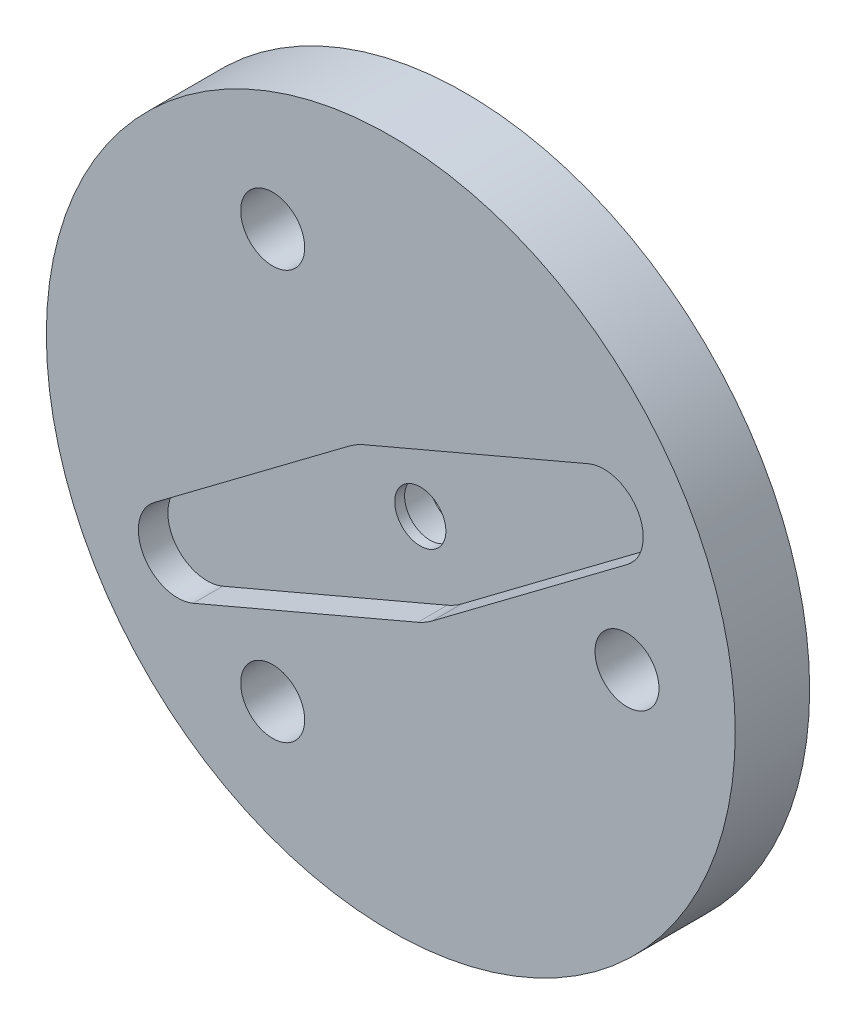
ISO-10303-21;
HEADER;
FILE_DESCRIPTION(('STEP AP214'),'2;1');
FILE_NAME('part.step','',(''),(''),'','','');
FILE_SCHEMA(('AUTOMOTIVE_DESIGN { 1 0 10303 214 1 1 1 1 }'));
ENDSEC;
DATA;
#1=APPLICATION_CONTEXT('core data for automotive mechanical design processes');
#2=APPLICATION_PROTOCOL_DEFINITION('international standard','automotive_design',2000,#1);
#3=PRODUCT_CONTEXT('',#1,'mechanical');
#4=PRODUCT('Part','Part','',(#3));
#5=PRODUCT_RELATED_PRODUCT_CATEGORY('part','',(#4));
#6=PRODUCT_DEFINITION_FORMATION('','',#4);
#7=PRODUCT_DEFINITION_CONTEXT('part definition',#1,'design');
#8=PRODUCT_DEFINITION('design','',#6,#7);
#9=PRODUCT_DEFINITION_SHAPE('','',#8);
#10=(LENGTH_UNIT() NAMED_UNIT(*) SI_UNIT(.MILLI.,.METRE.));
#11=(NAMED_UNIT(*) PLANE_ANGLE_UNIT() SI_UNIT($,.RADIAN.));
#12=(NAMED_UNIT(*) SI_UNIT($,.STERADIAN.) SOLID_ANGLE_UNIT());
#13=UNCERTAINTY_MEASURE_WITH_UNIT(LENGTH_MEASURE(1.E-05),#10,'distance_accuracy_value','');
#14=(GEOMETRIC_REPRESENTATION_CONTEXT(3) GLOBAL_UNCERTAINTY_ASSIGNED_CONTEXT((#13)) GLOBAL_UNIT_ASSIGNED_CONTEXT((#10,
#11,#12)) REPRESENTATION_CONTEXT('',''));
#15=CARTESIAN_POINT('',(0.,0.,0.));
#16=DIRECTION('',(0.,0.,1.));
#17=DIRECTION('',(1.,0.,0.));
#18=AXIS2_PLACEMENT_3D('',#15,#16,#17);
#19=CARTESIAN_POINT('',(0.,0.,0.));
#20=DIRECTION('',(0.,0.,1.));
#21=DIRECTION('',(1.,0.,0.));
#22=AXIS2_PLACEMENT_3D('',#19,#20,#21);
#23=CYLINDRICAL_SURFACE('',#22,1.3);
#24=CARTESIAN_POINT('',(0.,0.,1.78109250195854));
#25=DIRECTION('',(0.,0.,1.));
#26=DIRECTION('',(1.,0.,0.));
#27=AXIS2_PLACEMENT_3D('',#24,#25,#26);
#28=CIRCLE('',#27,1.3);
#29=CARTESIAN_POINT('',(1.3,0.,1.78109250195854));
#30=VERTEX_POINT('',#29);
#31=EDGE_CURVE('E44',#30,#30,#28,.F.);
#32=ORIENTED_EDGE('',*,*,#31,.T.);
#33=EDGE_LOOP('',(#32));
#34=FACE_BOUND('',#33,.T.);
#35=CARTESIAN_POINT('',(0.,0.,2.28109250195854));
#36=DIRECTION('',(0.,0.,1.));
#37=DIRECTION('',(1.,0.,0.));
#38=AXIS2_PLACEMENT_3D('',#35,#36,#37);
#39=CIRCLE('',#38,1.3);
#40=CARTESIAN_POINT('',(1.3,0.,2.28109250195854));
#41=VERTEX_POINT('',#40);
#42=EDGE_CURVE('E178',#41,#41,#39,.F.);
#43=ORIENTED_EDGE('',*,*,#42,.F.);
#44=EDGE_LOOP('',(#43));
#45=FACE_BOUND('',#44,.T.);
#46=ADVANCED_FACE('F40',(#34,#45),#23,.F.);
#47=CARTESIAN_POINT('',(0.,0.,3.78109250195854));
#48=DIRECTION('',(0.,0.,-1.));
#49=DIRECTION('',(-1.,0.,0.));
#50=AXIS2_PLACEMENT_3D('',#47,#48,#49);
#51=CYLINDRICAL_SURFACE('',#50,17.5);
#52=CARTESIAN_POINT('',(0.,0.,3.78109250195854));
#53=DIRECTION('',(0.,0.,1.));
#54=DIRECTION('',(1.,0.,0.));
#55=AXIS2_PLACEMENT_3D('',#52,#53,#54);
#56=CIRCLE('',#55,17.5);
#57=CARTESIAN_POINT('',(17.5,0.,3.78109250195854));
#58=VERTEX_POINT('',#57);
#59=EDGE_CURVE('E12',#58,#58,#56,.T.);
#60=ORIENTED_EDGE('',*,*,#59,.F.);
#61=EDGE_LOOP('',(#60));
#62=FACE_BOUND('',#61,.T.);
#63=CARTESIAN_POINT('',(0.,0.,0.));
#64=DIRECTION('',(0.,0.,1.));
#65=DIRECTION('',(1.,0.,0.));
#66=AXIS2_PLACEMENT_3D('',#63,#64,#65);
#67=CIRCLE('',#66,17.5);
#68=CARTESIAN_POINT('',(17.5,0.,0.));
#69=VERTEX_POINT('',#68);
#70=EDGE_CURVE('E50',#69,#69,#67,.T.);
#71=ORIENTED_EDGE('',*,*,#70,.T.);
#72=EDGE_LOOP('',(#71));
#73=FACE_BOUND('',#72,.T.);
#74=ADVANCED_FACE('F42',(#62,#73),#51,.T.);
#75=CARTESIAN_POINT('',(0.,0.,3.78109250195854));
#76=DIRECTION('',(0.,0.,1.));
#77=DIRECTION('',(1.,0.,0.));
#78=AXIS2_PLACEMENT_3D('',#75,#76,#77);
#79=PLANE('',#78);
#80=CARTESIAN_POINT('',(10.8253175473055,6.24999999999998,3.78109250195854));
#81=DIRECTION('',(0.,0.,1.));
#82=DIRECTION('',(1.,0.,0.));
#83=AXIS2_PLACEMENT_3D('',#80,#81,#82);
#84=CIRCLE('',#83,2.);
#85=CARTESIAN_POINT('',(12.025937535893,4.6504651791836,3.78109250195854));
#86=VERTEX_POINT('',#85);
#87=CARTESIAN_POINT('',(10.0403897525345,8.08953482081635,3.78109250195854));
#88=VERTEX_POINT('',#87);
#89=EDGE_CURVE('E58',#86,#88,#84,.T.);
#90=ORIENTED_EDGE('',*,*,#89,.F.);
#91=DIRECTION('',(0.799767410408188,0.600309994293765,0.));
#92=VECTOR('',#91,1.);
#93=CARTESIAN_POINT('',(2.10108498002818,-2.79918593642866,3.78109250195854));
#94=LINE('',#93,#92);
#95=CARTESIAN_POINT('',(2.10108498002818,-2.79918593642866,3.78109250195854));
#96=VERTEX_POINT('',#95);
#97=EDGE_CURVE('E172',#96,#86,#94,.T.);
#98=ORIENTED_EDGE('',*,*,#97,.F.);
#99=CARTESIAN_POINT('',(0.,0.,3.78109250195854));
#100=DIRECTION('',(0.,0.,1.));
#101=DIRECTION('',(1.,0.,0.));
#102=AXIS2_PLACEMENT_3D('',#99,#100,#101);
#103=CIRCLE('',#102,3.5);
#104=CARTESIAN_POINT('',(1.37362364084925,-3.21918593642866,3.78109250195854));
#105=VERTEX_POINT('',#104);
#106=EDGE_CURVE('E169',#105,#96,#103,.T.);
#107=ORIENTED_EDGE('',*,*,#106,.F.);
#108=DIRECTION('',(0.919767410408188,0.3924638973855,0.));
#109=VECTOR('',#108,1.);
#110=CARTESIAN_POINT('',(-10.0403897525345,-8.08953482081635,3.78109250195854));
#111=LINE('',#110,#109);
#112=CARTESIAN_POINT('',(-10.0403897525345,-8.08953482081635,3.78109250195854));
#113=VERTEX_POINT('',#112);
#114=EDGE_CURVE('E118',#113,#105,#111,.T.);
#115=ORIENTED_EDGE('',*,*,#114,.F.);
#116=CARTESIAN_POINT('',(-10.8253175473055,-6.24999999999998,3.78109250195854));
#117=DIRECTION('',(0.,0.,1.));
#118=DIRECTION('',(1.,0.,0.));
#119=AXIS2_PLACEMENT_3D('',#116,#117,#118);
#120=CIRCLE('',#119,2.);
#121=CARTESIAN_POINT('',(-12.025937535893,-4.6504651791836,3.78109250195854));
#122=VERTEX_POINT('',#121);
#123=EDGE_CURVE('E163',#122,#113,#120,.T.);
#124=ORIENTED_EDGE('',*,*,#123,.F.);
#125=DIRECTION('',(-0.799767410408188,-0.600309994293765,0.));
#126=VECTOR('',#125,1.);
#127=CARTESIAN_POINT('',(-2.10108498002818,2.79918593642866,3.78109250195854));
#128=LINE('',#127,#126);
#129=CARTESIAN_POINT('',(-2.10108498002818,2.79918593642866,3.78109250195854));
#130=VERTEX_POINT('',#129);
#131=EDGE_CURVE('E159',#130,#122,#128,.T.);
#132=ORIENTED_EDGE('',*,*,#131,.F.);
#133=CARTESIAN_POINT('',(0.,0.,3.78109250195854));
#134=DIRECTION('',(0.,0.,1.));
#135=DIRECTION('',(1.,0.,0.));
#136=AXIS2_PLACEMENT_3D('',#133,#134,#135);
#137=CIRCLE('',#136,3.5);
#138=CARTESIAN_POINT('',(-1.37362364084925,3.21918593642866,3.78109250195854));
#139=VERTEX_POINT('',#138);
#140=EDGE_CURVE('E155',#139,#130,#137,.T.);
#141=ORIENTED_EDGE('',*,*,#140,.F.);
#142=DIRECTION('',(-0.919767410408188,-0.3924638973855,0.));
#143=VECTOR('',#142,1.);
#144=CARTESIAN_POINT('',(10.0403897525345,8.08953482081635,3.78109250195854));
#145=LINE('',#144,#143);
#146=EDGE_CURVE('E151',#88,#139,#145,.T.);
#147=ORIENTED_EDGE('',*,*,#146,.F.);
#148=EDGE_LOOP('',(#90,#98,#107,#115,#124,#132,#141,#147));
#149=FACE_BOUND('',#148,.T.);
#150=CARTESIAN_POINT('',(-5.99999999999998,10.3923048454133,3.78109250195854));
#151=DIRECTION('',(0.,0.,1.));
#152=DIRECTION('',(1.,0.,0.));
#153=AXIS2_PLACEMENT_3D('',#150,#151,#152);
#154=CIRCLE('',#153,1.625);
#155=CARTESIAN_POINT('',(-4.37499999999998,10.3923048454133,3.78109250195854));
#156=VERTEX_POINT('',#155);
#157=EDGE_CURVE('E198',#156,#156,#154,.T.);
#158=ORIENTED_EDGE('',*,*,#157,.F.);
#159=EDGE_LOOP('',(#158));
#160=FACE_BOUND('',#159,.T.);
#161=CARTESIAN_POINT('',(-5.99999999999997,-10.3923048454133,3.78109250195854));
#162=DIRECTION('',(0.,0.,1.));
#163=DIRECTION('',(1.,0.,0.));
#164=AXIS2_PLACEMENT_3D('',#161,#162,#163);
#165=CIRCLE('',#164,1.625);
#166=CARTESIAN_POINT('',(-4.37499999999997,-10.3923048454133,3.78109250195854));
#167=VERTEX_POINT('',#166);
#168=EDGE_CURVE('E206',#167,#167,#165,.T.);
#169=ORIENTED_EDGE('',*,*,#168,.F.);
#170=EDGE_LOOP('',(#169));
#171=FACE_BOUND('',#170,.T.);
#172=CARTESIAN_POINT('',(12.,0.,3.78109250195854));
#173=DIRECTION('',(0.,0.,1.));
#174=DIRECTION('',(1.,0.,0.));
#175=AXIS2_PLACEMENT_3D('',#172,#173,#174);
#176=CIRCLE('',#175,1.625);
#177=CARTESIAN_POINT('',(13.625,0.,3.78109250195854));
#178=VERTEX_POINT('',#177);
#179=EDGE_CURVE('E214',#178,#178,#176,.T.);
#180=ORIENTED_EDGE('',*,*,#179,.F.);
#181=EDGE_LOOP('',(#180));
#182=FACE_BOUND('',#181,.T.);
#183=ORIENTED_EDGE('',*,*,#59,.T.);
#184=EDGE_LOOP('',(#183));
#185=FACE_BOUND('',#184,.T.);
#186=ADVANCED_FACE('F232',(#149,#160,#171,#182,#185),#79,.T.);
#187=CARTESIAN_POINT('',(0.,0.,0.));
#188=DIRECTION('',(0.,0.,1.));
#189=DIRECTION('',(1.,0.,0.));
#190=AXIS2_PLACEMENT_3D('',#187,#188,#189);
#191=PLANE('',#190);
#192=CARTESIAN_POINT('',(0.,0.,0.));
#193=DIRECTION('',(0.,0.,-1.));
#194=DIRECTION('',(-1.,0.,0.));
#195=AXIS2_PLACEMENT_3D('',#192,#193,#194);
#196=CIRCLE('',#195,2.);
#197=CARTESIAN_POINT('',(-2.,0.,0.));
#198=VERTEX_POINT('',#197);
#199=EDGE_CURVE('E257',#198,#198,#196,.T.);
#200=ORIENTED_EDGE('',*,*,#199,.F.);
#201=EDGE_LOOP('',(#200));
#202=FACE_BOUND('',#201,.T.);
#203=CARTESIAN_POINT('',(-5.99999999999998,10.3923048454133,0.));
#204=DIRECTION('',(0.,0.,1.));
#205=DIRECTION('',(1.,0.,0.));
#206=AXIS2_PLACEMENT_3D('',#203,#204,#205);
#207=CIRCLE('',#206,1.625);
#208=CARTESIAN_POINT('',(-4.37499999999998,10.3923048454133,0.));
#209=VERTEX_POINT('',#208);
#210=EDGE_CURVE('E194',#209,#209,#207,.T.);
#211=ORIENTED_EDGE('',*,*,#210,.T.);
#212=EDGE_LOOP('',(#211));
#213=FACE_BOUND('',#212,.T.);
#214=CARTESIAN_POINT('',(-5.99999999999997,-10.3923048454133,0.));
#215=DIRECTION('',(0.,0.,1.));
#216=DIRECTION('',(1.,0.,0.));
#217=AXIS2_PLACEMENT_3D('',#214,#215,#216);
#218=CIRCLE('',#217,1.625);
#219=CARTESIAN_POINT('',(-4.37499999999997,-10.3923048454133,0.));
#220=VERTEX_POINT('',#219);
#221=EDGE_CURVE('E202',#220,#220,#218,.T.);
#222=ORIENTED_EDGE('',*,*,#221,.T.);
#223=EDGE_LOOP('',(#222));
#224=FACE_BOUND('',#223,.T.);
#225=CARTESIAN_POINT('',(12.,0.,0.));
#226=DIRECTION('',(0.,0.,1.));
#227=DIRECTION('',(1.,0.,0.));
#228=AXIS2_PLACEMENT_3D('',#225,#226,#227);
#229=CIRCLE('',#228,1.625);
#230=CARTESIAN_POINT('',(13.625,0.,0.));
#231=VERTEX_POINT('',#230);
#232=EDGE_CURVE('E210',#231,#231,#229,.T.);
#233=ORIENTED_EDGE('',*,*,#232,.T.);
#234=EDGE_LOOP('',(#233));
#235=FACE_BOUND('',#234,.T.);
#236=ORIENTED_EDGE('',*,*,#70,.F.);
#237=EDGE_LOOP('',(#236));
#238=FACE_BOUND('',#237,.T.);
#239=ADVANCED_FACE('F246',(#202,#213,#224,#235,#238),#191,.F.);
#240=CARTESIAN_POINT('',(12.,0.,0.));
#241=DIRECTION('',(0.,0.,1.));
#242=DIRECTION('',(1.,0.,0.));
#243=AXIS2_PLACEMENT_3D('',#240,#241,#242);
#244=CYLINDRICAL_SURFACE('',#243,1.625);
#245=ORIENTED_EDGE('',*,*,#232,.F.);
#246=EDGE_LOOP('',(#245));
#247=FACE_BOUND('',#246,.T.);
#248=ORIENTED_EDGE('',*,*,#179,.T.);
#249=EDGE_LOOP('',(#248));
#250=FACE_BOUND('',#249,.T.);
#251=ADVANCED_FACE('F242',(#247,#250),#244,.F.);
#252=CARTESIAN_POINT('',(-5.99999999999997,-10.3923048454133,0.));
#253=DIRECTION('',(0.,0.,1.));
#254=DIRECTION('',(1.,0.,0.));
#255=AXIS2_PLACEMENT_3D('',#252,#253,#254);
#256=CYLINDRICAL_SURFACE('',#255,1.625);
#257=ORIENTED_EDGE('',*,*,#221,.F.);
#258=EDGE_LOOP('',(#257));
#259=FACE_BOUND('',#258,.T.);
#260=ORIENTED_EDGE('',*,*,#168,.T.);
#261=EDGE_LOOP('',(#260));
#262=FACE_BOUND('',#261,.T.);
#263=ADVANCED_FACE('F239',(#259,#262),#256,.F.);
#264=CARTESIAN_POINT('',(-5.99999999999998,10.3923048454133,0.));
#265=DIRECTION('',(0.,0.,1.));
#266=DIRECTION('',(1.,0.,0.));
#267=AXIS2_PLACEMENT_3D('',#264,#265,#266);
#268=CYLINDRICAL_SURFACE('',#267,1.625);
#269=ORIENTED_EDGE('',*,*,#210,.F.);
#270=EDGE_LOOP('',(#269));
#271=FACE_BOUND('',#270,.T.);
#272=ORIENTED_EDGE('',*,*,#157,.T.);
#273=EDGE_LOOP('',(#272));
#274=FACE_BOUND('',#273,.T.);
#275=ADVANCED_FACE('F237',(#271,#274),#268,.F.);
#276=CARTESIAN_POINT('',(10.8253175473055,6.24999999999998,2.28109250195854));
#277=DIRECTION('',(0.,0.,1.));
#278=DIRECTION('',(1.,0.,0.));
#279=AXIS2_PLACEMENT_3D('',#276,#277,#278);
#280=PLANE('',#279);
#281=CARTESIAN_POINT('',(10.8253175473055,6.24999999999998,2.28109250195854));
#282=DIRECTION('',(0.,0.,1.));
#283=DIRECTION('',(1.,0.,0.));
#284=AXIS2_PLACEMENT_3D('',#281,#282,#283);
#285=CIRCLE('',#284,2.);
#286=CARTESIAN_POINT('',(12.025937535893,4.6504651791836,2.28109250195854));
#287=VERTEX_POINT('',#286);
#288=CARTESIAN_POINT('',(10.0403897525345,8.08953482081635,2.28109250195854));
#289=VERTEX_POINT('',#288);
#290=EDGE_CURVE('E175',#287,#289,#285,.T.);
#291=ORIENTED_EDGE('',*,*,#290,.T.);
#292=DIRECTION('',(-0.919767410408188,-0.3924638973855,0.));
#293=VECTOR('',#292,1.);
#294=CARTESIAN_POINT('',(10.0403897525345,8.08953482081635,2.28109250195854));
#295=LINE('',#294,#293);
#296=CARTESIAN_POINT('',(-1.37362364084925,3.21918593642866,2.28109250195854));
#297=VERTEX_POINT('',#296);
#298=EDGE_CURVE('E327',#289,#297,#295,.T.);
#299=ORIENTED_EDGE('',*,*,#298,.T.);
#300=CARTESIAN_POINT('',(0.,0.,2.28109250195854));
#301=DIRECTION('',(0.,0.,1.));
#302=DIRECTION('',(1.,0.,0.));
#303=AXIS2_PLACEMENT_3D('',#300,#301,#302);
#304=CIRCLE('',#303,3.5);
#305=CARTESIAN_POINT('',(-2.10108498002818,2.79918593642866,2.28109250195854));
#306=VERTEX_POINT('',#305);
#307=EDGE_CURVE('E324',#297,#306,#304,.T.);
#308=ORIENTED_EDGE('',*,*,#307,.T.);
#309=DIRECTION('',(-0.799767410408188,-0.600309994293765,0.));
#310=VECTOR('',#309,1.);
#311=CARTESIAN_POINT('',(-2.10108498002818,2.79918593642866,2.28109250195854));
#312=LINE('',#311,#310);
#313=CARTESIAN_POINT('',(-12.025937535893,-4.6504651791836,2.28109250195854));
#314=VERTEX_POINT('',#313);
#315=EDGE_CURVE('E143',#306,#314,#312,.T.);
#316=ORIENTED_EDGE('',*,*,#315,.T.);
#317=CARTESIAN_POINT('',(-10.8253175473055,-6.24999999999998,2.28109250195854));
#318=DIRECTION('',(0.,0.,1.));
#319=DIRECTION('',(1.,0.,0.));
#320=AXIS2_PLACEMENT_3D('',#317,#318,#319);
#321=CIRCLE('',#320,2.);
#322=CARTESIAN_POINT('',(-10.0403897525345,-8.08953482081635,2.28109250195854));
#323=VERTEX_POINT('',#322);
#324=EDGE_CURVE('E139',#314,#323,#321,.T.);
#325=ORIENTED_EDGE('',*,*,#324,.T.);
#326=DIRECTION('',(0.919767410408188,0.3924638973855,0.));
#327=VECTOR('',#326,1.);
#328=CARTESIAN_POINT('',(-10.0403897525345,-8.08953482081635,2.28109250195854));
#329=LINE('',#328,#327);
#330=CARTESIAN_POINT('',(1.37362364084925,-3.21918593642866,2.28109250195854));
#331=VERTEX_POINT('',#330);
#332=EDGE_CURVE('E115',#323,#331,#329,.T.);
#333=ORIENTED_EDGE('',*,*,#332,.T.);
#334=CARTESIAN_POINT('',(0.,0.,2.28109250195854));
#335=DIRECTION('',(0.,0.,1.));
#336=DIRECTION('',(1.,0.,0.));
#337=AXIS2_PLACEMENT_3D('',#334,#335,#336);
#338=CIRCLE('',#337,3.5);
#339=CARTESIAN_POINT('',(2.10108498002818,-2.79918593642866,2.28109250195854));
#340=VERTEX_POINT('',#339);
#341=EDGE_CURVE('E127',#331,#340,#338,.T.);
#342=ORIENTED_EDGE('',*,*,#341,.T.);
#343=DIRECTION('',(0.799767410408188,0.600309994293765,0.));
#344=VECTOR('',#343,1.);
#345=CARTESIAN_POINT('',(2.10108498002818,-2.79918593642866,2.28109250195854));
#346=LINE('',#345,#344);
#347=EDGE_CURVE('E132',#340,#287,#346,.T.);
#348=ORIENTED_EDGE('',*,*,#347,.T.);
#349=EDGE_LOOP('',(#291,#299,#308,#316,#325,#333,#342,#348));
#350=FACE_BOUND('',#349,.T.);
#351=ORIENTED_EDGE('',*,*,#42,.T.);
#352=EDGE_LOOP('',(#351));
#353=FACE_BOUND('',#352,.T.);
#354=ADVANCED_FACE('F135',(#350,#353),#280,.T.);
#355=CARTESIAN_POINT('',(10.8253175473055,6.24999999999998,2.28109250195854));
#356=DIRECTION('',(0.,0.,1.));
#357=DIRECTION('',(1.,0.,0.));
#358=AXIS2_PLACEMENT_3D('',#355,#356,#357);
#359=CYLINDRICAL_SURFACE('',#358,2.);
#360=ORIENTED_EDGE('',*,*,#89,.T.);
#361=DIRECTION('',(0.,0.,1.));
#362=VECTOR('',#361,1.);
#363=CARTESIAN_POINT('',(10.0403897525345,8.08953482081635,2.28109250195854));
#364=LINE('',#363,#362);
#365=EDGE_CURVE('E94',#289,#88,#364,.T.);
#366=ORIENTED_EDGE('',*,*,#365,.F.);
#367=ORIENTED_EDGE('',*,*,#290,.F.);
#368=DIRECTION('',(0.,0.,1.));
#369=VECTOR('',#368,1.);
#370=CARTESIAN_POINT('',(12.025937535893,4.6504651791836,2.28109250195854));
#371=LINE('',#370,#369);
#372=EDGE_CURVE('E66',#287,#86,#371,.T.);
#373=ORIENTED_EDGE('',*,*,#372,.T.);
#374=EDGE_LOOP('',(#360,#366,#367,#373));
#375=FACE_BOUND('',#374,.T.);
#376=ADVANCED_FACE('F282',(#375),#359,.F.);
#377=CARTESIAN_POINT('',(2.10108498002818,-2.79918593642866,2.28109250195854));
#378=DIRECTION('',(0.600309994293765,-0.799767410408188,0.));
#379=DIRECTION('',(0.799767410408188,0.600309994293765,0.));
#380=AXIS2_PLACEMENT_3D('',#377,#378,#379);
#381=PLANE('',#380);
#382=ORIENTED_EDGE('',*,*,#97,.T.);
#383=ORIENTED_EDGE('',*,*,#372,.F.);
#384=ORIENTED_EDGE('',*,*,#347,.F.);
#385=DIRECTION('',(0.,0.,1.));
#386=VECTOR('',#385,1.);
#387=CARTESIAN_POINT('',(2.10108498002818,-2.79918593642866,2.28109250195854));
#388=LINE('',#387,#386);
#389=EDGE_CURVE('E123',#340,#96,#388,.T.);
#390=ORIENTED_EDGE('',*,*,#389,.T.);
#391=EDGE_LOOP('',(#382,#383,#384,#390));
#392=FACE_BOUND('',#391,.T.);
#393=ADVANCED_FACE('F287',(#392),#381,.F.);
#394=CARTESIAN_POINT('',(0.,0.,2.28109250195854));
#395=DIRECTION('',(0.,0.,1.));
#396=DIRECTION('',(1.,0.,0.));
#397=AXIS2_PLACEMENT_3D('',#394,#395,#396);
#398=CYLINDRICAL_SURFACE('',#397,3.5);
#399=ORIENTED_EDGE('',*,*,#106,.T.);
#400=ORIENTED_EDGE('',*,*,#389,.F.);
#401=ORIENTED_EDGE('',*,*,#341,.F.);
#402=DIRECTION('',(0.,0.,1.));
#403=VECTOR('',#402,1.);
#404=CARTESIAN_POINT('',(1.37362364084925,-3.21918593642866,2.28109250195854));
#405=LINE('',#404,#403);
#406=EDGE_CURVE('E111',#331,#105,#405,.T.);
#407=ORIENTED_EDGE('',*,*,#406,.T.);
#408=EDGE_LOOP('',(#399,#400,#401,#407));
#409=FACE_BOUND('',#408,.T.);
#410=ADVANCED_FACE('F128',(#409),#398,.F.);
#411=CARTESIAN_POINT('',(-10.0403897525345,-8.08953482081635,2.28109250195854));
#412=DIRECTION('',(0.3924638973855,-0.919767410408188,0.));
#413=DIRECTION('',(0.919767410408188,0.3924638973855,0.));
#414=AXIS2_PLACEMENT_3D('',#411,#412,#413);
#415=PLANE('',#414);
#416=ORIENTED_EDGE('',*,*,#114,.T.);
#417=ORIENTED_EDGE('',*,*,#406,.F.);
#418=ORIENTED_EDGE('',*,*,#332,.F.);
#419=DIRECTION('',(0.,0.,1.));
#420=VECTOR('',#419,1.);
#421=CARTESIAN_POINT('',(-10.0403897525345,-8.08953482081635,2.28109250195854));
#422=LINE('',#421,#420);
#423=EDGE_CURVE('E124',#323,#113,#422,.T.);
#424=ORIENTED_EDGE('',*,*,#423,.T.);
#425=EDGE_LOOP('',(#416,#417,#418,#424));
#426=FACE_BOUND('',#425,.T.);
#427=ADVANCED_FACE('F113',(#426),#415,.F.);
#428=CARTESIAN_POINT('',(-10.8253175473055,-6.24999999999998,2.28109250195854));
#429=DIRECTION('',(0.,0.,1.));
#430=DIRECTION('',(1.,0.,0.));
#431=AXIS2_PLACEMENT_3D('',#428,#429,#430);
#432=CYLINDRICAL_SURFACE('',#431,2.);
#433=ORIENTED_EDGE('',*,*,#123,.T.);
#434=ORIENTED_EDGE('',*,*,#423,.F.);
#435=ORIENTED_EDGE('',*,*,#324,.F.);
#436=DIRECTION('',(0.,0.,1.));
#437=VECTOR('',#436,1.);
#438=CARTESIAN_POINT('',(-12.025937535893,-4.6504651791836,2.28109250195854));
#439=LINE('',#438,#437);
#440=EDGE_CURVE('E183',#314,#122,#439,.T.);
#441=ORIENTED_EDGE('',*,*,#440,.T.);
#442=EDGE_LOOP('',(#433,#434,#435,#441));
#443=FACE_BOUND('',#442,.T.);
#444=ADVANCED_FACE('F298',(#443),#432,.F.);
#445=CARTESIAN_POINT('',(-2.10108498002818,2.79918593642866,2.28109250195854));
#446=DIRECTION('',(-0.600309994293765,0.799767410408188,0.));
#447=DIRECTION('',(-0.799767410408188,-0.600309994293765,0.));
#448=AXIS2_PLACEMENT_3D('',#445,#446,#447);
#449=PLANE('',#448);
#450=ORIENTED_EDGE('',*,*,#131,.T.);
#451=ORIENTED_EDGE('',*,*,#440,.F.);
#452=ORIENTED_EDGE('',*,*,#315,.F.);
#453=DIRECTION('',(0.,0.,1.));
#454=VECTOR('',#453,1.);
#455=CARTESIAN_POINT('',(-2.10108498002818,2.79918593642866,2.28109250195854));
#456=LINE('',#455,#454);
#457=EDGE_CURVE('E186',#306,#130,#456,.T.);
#458=ORIENTED_EDGE('',*,*,#457,.T.);
#459=EDGE_LOOP('',(#450,#451,#452,#458));
#460=FACE_BOUND('',#459,.T.);
#461=ADVANCED_FACE('F301',(#460),#449,.F.);
#462=CARTESIAN_POINT('',(0.,0.,2.28109250195854));
#463=DIRECTION('',(0.,0.,1.));
#464=DIRECTION('',(1.,0.,0.));
#465=AXIS2_PLACEMENT_3D('',#462,#463,#464);
#466=CYLINDRICAL_SURFACE('',#465,3.5);
#467=ORIENTED_EDGE('',*,*,#140,.T.);
#468=ORIENTED_EDGE('',*,*,#457,.F.);
#469=ORIENTED_EDGE('',*,*,#307,.F.);
#470=DIRECTION('',(0.,0.,1.));
#471=VECTOR('',#470,1.);
#472=CARTESIAN_POINT('',(-1.37362364084925,3.21918593642866,2.28109250195854));
#473=LINE('',#472,#471);
#474=EDGE_CURVE('E189',#297,#139,#473,.T.);
#475=ORIENTED_EDGE('',*,*,#474,.T.);
#476=EDGE_LOOP('',(#467,#468,#469,#475));
#477=FACE_BOUND('',#476,.T.);
#478=ADVANCED_FACE('F305',(#477),#466,.F.);
#479=CARTESIAN_POINT('',(10.0403897525345,8.08953482081635,2.28109250195854));
#480=DIRECTION('',(-0.3924638973855,0.919767410408188,0.));
#481=DIRECTION('',(-0.919767410408188,-0.3924638973855,0.));
#482=AXIS2_PLACEMENT_3D('',#479,#480,#481);
#483=PLANE('',#482);
#484=ORIENTED_EDGE('',*,*,#146,.T.);
#485=ORIENTED_EDGE('',*,*,#474,.F.);
#486=ORIENTED_EDGE('',*,*,#298,.F.);
#487=ORIENTED_EDGE('',*,*,#365,.T.);
#488=EDGE_LOOP('',(#484,#485,#486,#487));
#489=FACE_BOUND('',#488,.T.);
#490=ADVANCED_FACE('F309',(#489),#483,.F.);
#491=CARTESIAN_POINT('',(10.8253175473055,6.24999999999998,1.78109250195854));
#492=DIRECTION('',(0.,0.,1.));
#493=DIRECTION('',(1.,0.,0.));
#494=AXIS2_PLACEMENT_3D('',#491,#492,#493);
#495=PLANE('',#494);
#496=CARTESIAN_POINT('',(0.,0.,1.78109250195854));
#497=DIRECTION('',(0.,0.,1.));
#498=DIRECTION('',(1.,0.,0.));
#499=AXIS2_PLACEMENT_3D('',#496,#497,#498);
#500=CIRCLE('',#499,2.);
#501=CARTESIAN_POINT('',(2.,0.,1.78109250195854));
#502=VERTEX_POINT('',#501);
#503=EDGE_CURVE('E336',#502,#502,#500,.F.);
#504=ORIENTED_EDGE('',*,*,#503,.T.);
#505=EDGE_LOOP('',(#504));
#506=FACE_BOUND('',#505,.T.);
#507=ORIENTED_EDGE('',*,*,#31,.F.);
#508=EDGE_LOOP('',(#507));
#509=FACE_BOUND('',#508,.T.);
#510=ADVANCED_FACE('F290',(#506,#509),#495,.F.);
#511=CARTESIAN_POINT('',(0.,0.,7.93794675145092));
#512=DIRECTION('',(0.,0.,-1.));
#513=DIRECTION('',(-1.,0.,0.));
#514=AXIS2_PLACEMENT_3D('',#511,#512,#513);
#515=CYLINDRICAL_SURFACE('',#514,2.);
#516=ORIENTED_EDGE('',*,*,#199,.T.);
#517=EDGE_LOOP('',(#516));
#518=FACE_BOUND('',#517,.T.);
#519=ORIENTED_EDGE('',*,*,#503,.F.);
#520=EDGE_LOOP('',(#519));
#521=FACE_BOUND('',#520,.T.);
#522=ADVANCED_FACE('F315',(#518,#521),#515,.F.);
#523=CLOSED_SHELL('',(#46,#74,#186,#239,#251,#263,#275,#354,#376,#393,#410,#427,#444,#461,#478,
#490,#510,#522));
#524=MANIFOLD_SOLID_BREP('B2',#523);
#525=ADVANCED_BREP_SHAPE_REPRESENTATION('',(#18,#524),#14);
#526=SHAPE_DEFINITION_REPRESENTATION(#9,#525);
ENDSEC;
END-ISO-10303-21;
